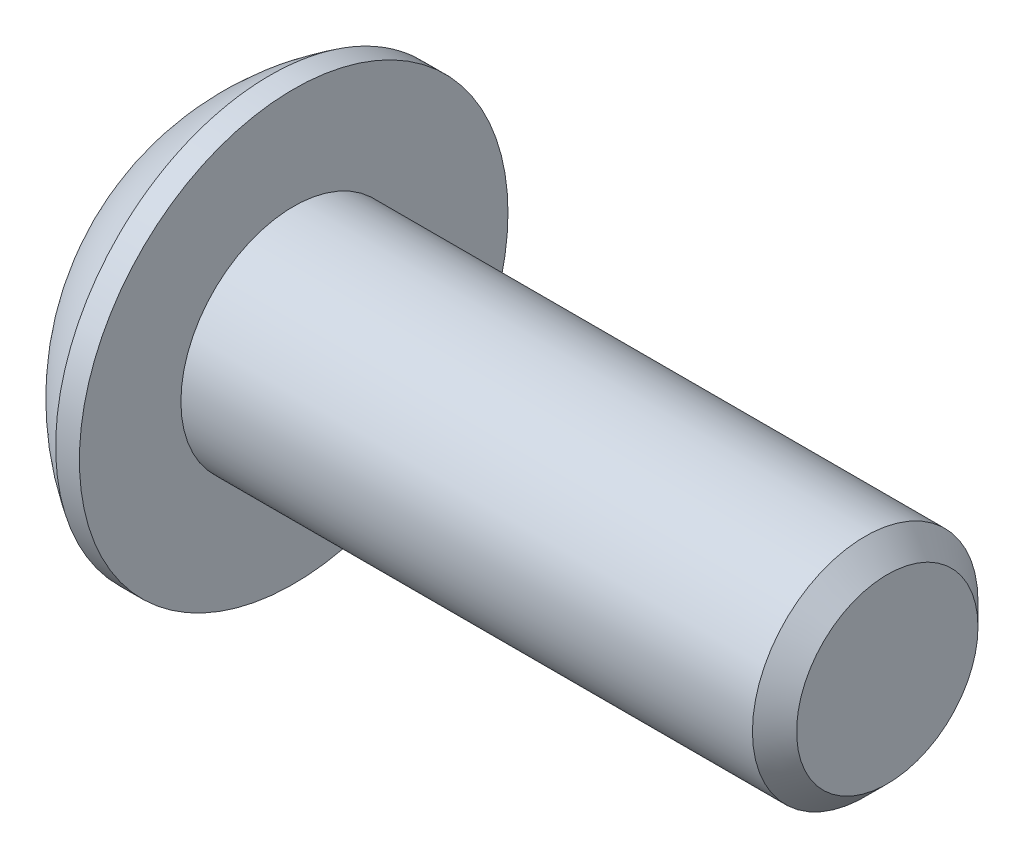
ISO-10303-21;
HEADER;
FILE_DESCRIPTION(('STEP AP214'),'2;1');
FILE_NAME('part.step','',(''),(''),'','','');
FILE_SCHEMA(('AUTOMOTIVE_DESIGN { 1 0 10303 214 1 1 1 1 }'));
ENDSEC;
DATA;
#1=APPLICATION_CONTEXT('core data for automotive mechanical design processes');
#2=APPLICATION_PROTOCOL_DEFINITION('international standard','automotive_design',2000,#1);
#3=PRODUCT_CONTEXT('',#1,'mechanical');
#4=PRODUCT('Part','Part','',(#3));
#5=PRODUCT_RELATED_PRODUCT_CATEGORY('part','',(#4));
#6=PRODUCT_DEFINITION_FORMATION('','',#4);
#7=PRODUCT_DEFINITION_CONTEXT('part definition',#1,'design');
#8=PRODUCT_DEFINITION('design','',#6,#7);
#9=PRODUCT_DEFINITION_SHAPE('','',#8);
#10=(LENGTH_UNIT() NAMED_UNIT(*) SI_UNIT(.MILLI.,.METRE.));
#11=(NAMED_UNIT(*) PLANE_ANGLE_UNIT() SI_UNIT($,.RADIAN.));
#12=(NAMED_UNIT(*) SI_UNIT($,.STERADIAN.) SOLID_ANGLE_UNIT());
#13=UNCERTAINTY_MEASURE_WITH_UNIT(LENGTH_MEASURE(1.E-05),#10,'distance_accuracy_value','');
#14=(GEOMETRIC_REPRESENTATION_CONTEXT(3) GLOBAL_UNCERTAINTY_ASSIGNED_CONTEXT((#13)) GLOBAL_UNIT_ASSIGNED_CONTEXT((#10,
#11,#12)) REPRESENTATION_CONTEXT('',''));
#15=CARTESIAN_POINT('',(0.,0.,0.));
#16=DIRECTION('',(0.,0.,1.));
#17=DIRECTION('',(1.,0.,0.));
#18=AXIS2_PLACEMENT_3D('',#15,#16,#17);
#19=CARTESIAN_POINT('',(1.77800000000017,0.,0.));
#20=DIRECTION('',(-1.,0.,0.));
#21=DIRECTION('',(0.,0.,-1.));
#22=AXIS2_PLACEMENT_3D('',#19,#20,#21);
#23=CONICAL_SURFACE('',#22,1.58749999999985,1.04719755119662);
#24=CARTESIAN_POINT('',(2.69454355233856,0.,0.));
#25=VERTEX_POINT('',#24);
#26=VERTEX_LOOP('',#25);
#27=FACE_BOUND('',#26,.T.);
#28=CARTESIAN_POINT('',(1.77800000000017,0.,0.));
#29=DIRECTION('',(1.,0.,0.));
#30=DIRECTION('',(0.,0.,-1.));
#31=AXIS2_PLACEMENT_3D('',#28,#29,#30);
#32=CIRCLE('',#31,1.58749999999985);
#33=CARTESIAN_POINT('',(1.77800000000008,0.,-1.58749999999993));
#34=VERTEX_POINT('',#33);
#35=CARTESIAN_POINT('',(1.77800000000008,-1.37481532850773,-0.793749999999965));
#36=VERTEX_POINT('',#35);
#37=EDGE_CURVE('E40',#34,#36,#32,.F.);
#38=ORIENTED_EDGE('',*,*,#37,.T.);
#39=CARTESIAN_POINT('',(1.77800000000017,0.,0.));
#40=DIRECTION('',(1.,0.,0.));
#41=DIRECTION('',(0.,0.,-1.));
#42=AXIS2_PLACEMENT_3D('',#39,#40,#41);
#43=CIRCLE('',#42,1.58749999999985);
#44=CARTESIAN_POINT('',(1.77800000000008,-1.37481532850773,0.793749999999965));
#45=VERTEX_POINT('',#44);
#46=EDGE_CURVE('E139',#36,#45,#43,.F.);
#47=ORIENTED_EDGE('',*,*,#46,.T.);
#48=CARTESIAN_POINT('',(1.77800000000017,0.,0.));
#49=DIRECTION('',(1.,0.,0.));
#50=DIRECTION('',(0.,0.,-1.));
#51=AXIS2_PLACEMENT_3D('',#48,#49,#50);
#52=CIRCLE('',#51,1.58749999999985);
#53=CARTESIAN_POINT('',(1.77800000000008,2.13833679173112E-12,1.58749999999993));
#54=VERTEX_POINT('',#53);
#55=EDGE_CURVE('E140',#45,#54,#52,.F.);
#56=ORIENTED_EDGE('',*,*,#55,.T.);
#57=CARTESIAN_POINT('',(1.77800000000017,0.,0.));
#58=DIRECTION('',(1.,0.,0.));
#59=DIRECTION('',(0.,0.,-1.));
#60=AXIS2_PLACEMENT_3D('',#57,#58,#59);
#61=CIRCLE('',#60,1.58749999999985);
#62=CARTESIAN_POINT('',(1.77800000000008,1.37481532850773,0.793749999999963));
#63=VERTEX_POINT('',#62);
#64=EDGE_CURVE('E142',#63,#54,#61,.T.);
#65=ORIENTED_EDGE('',*,*,#64,.F.);
#66=CARTESIAN_POINT('',(1.77800000000017,0.,0.));
#67=DIRECTION('',(1.,0.,0.));
#68=DIRECTION('',(0.,0.,-1.));
#69=AXIS2_PLACEMENT_3D('',#66,#67,#68);
#70=CIRCLE('',#69,1.58749999999985);
#71=CARTESIAN_POINT('',(1.77800000000008,1.37481532850773,-0.793749999999963));
#72=VERTEX_POINT('',#71);
#73=EDGE_CURVE('E135',#72,#63,#70,.T.);
#74=ORIENTED_EDGE('',*,*,#73,.F.);
#75=CARTESIAN_POINT('',(1.77800000000017,0.,0.));
#76=DIRECTION('',(1.,0.,0.));
#77=DIRECTION('',(0.,0.,-1.));
#78=AXIS2_PLACEMENT_3D('',#75,#76,#77);
#79=CIRCLE('',#78,1.58749999999985);
#80=EDGE_CURVE('E112',#34,#72,#79,.T.);
#81=ORIENTED_EDGE('',*,*,#80,.F.);
#82=EDGE_LOOP('',(#38,#47,#56,#65,#74,#81));
#83=FACE_BOUND('',#82,.T.);
#84=ADVANCED_FACE('F37',(#27,#83),#23,.F.);
#85=CARTESIAN_POINT('',(1.778,-1.83308710467706,0.));
#86=DIRECTION('',(1.,0.,0.));
#87=DIRECTION('',(0.,0.,1.));
#88=AXIS2_PLACEMENT_3D('',#85,#86,#87);
#89=PLANE('',#88);
#90=DIRECTION('',(0.,0.500000000000001,-0.866025403784438));
#91=VECTOR('',#90,1.);
#92=CARTESIAN_POINT('',(1.778,-1.83308710467706,0.));
#93=LINE('',#92,#91);
#94=CARTESIAN_POINT('',(1.778,-0.91654355233853,-1.5875));
#95=VERTEX_POINT('',#94);
#96=EDGE_CURVE('E128',#95,#36,#93,.F.);
#97=ORIENTED_EDGE('',*,*,#96,.T.);
#98=ORIENTED_EDGE('',*,*,#37,.F.);
#99=DIRECTION('',(0.,1.,0.));
#100=VECTOR('',#99,1.);
#101=CARTESIAN_POINT('',(1.778,-0.916543552338531,-1.5875));
#102=LINE('',#101,#100);
#103=EDGE_CURVE('E117',#34,#95,#102,.F.);
#104=ORIENTED_EDGE('',*,*,#103,.T.);
#105=EDGE_LOOP('',(#97,#98,#104));
#106=FACE_BOUND('',#105,.T.);
#107=ADVANCED_FACE('F137',(#106),#89,.F.);
#108=CARTESIAN_POINT('',(1.778,-1.83308710467706,0.));
#109=DIRECTION('',(1.,0.,0.));
#110=DIRECTION('',(0.,0.,1.));
#111=AXIS2_PLACEMENT_3D('',#108,#109,#110);
#112=PLANE('',#111);
#113=DIRECTION('',(0.,-0.500000000000001,-0.866025403784438));
#114=VECTOR('',#113,1.);
#115=CARTESIAN_POINT('',(1.778,-0.916543552338531,1.5875));
#116=LINE('',#115,#114);
#117=CARTESIAN_POINT('',(1.778,-1.83308710467706,0.));
#118=VERTEX_POINT('',#117);
#119=EDGE_CURVE('E233',#118,#45,#116,.F.);
#120=ORIENTED_EDGE('',*,*,#119,.T.);
#121=ORIENTED_EDGE('',*,*,#46,.F.);
#122=DIRECTION('',(0.,0.500000000000001,-0.866025403784438));
#123=VECTOR('',#122,1.);
#124=CARTESIAN_POINT('',(1.778,-1.83308710467706,0.));
#125=LINE('',#124,#123);
#126=EDGE_CURVE('E243',#36,#118,#125,.F.);
#127=ORIENTED_EDGE('',*,*,#126,.T.);
#128=EDGE_LOOP('',(#120,#121,#127));
#129=FACE_BOUND('',#128,.T.);
#130=ADVANCED_FACE('F293',(#129),#112,.F.);
#131=CARTESIAN_POINT('',(1.778,-1.83308710467706,0.));
#132=DIRECTION('',(1.,0.,0.));
#133=DIRECTION('',(0.,0.,1.));
#134=AXIS2_PLACEMENT_3D('',#131,#132,#133);
#135=PLANE('',#134);
#136=DIRECTION('',(0.,1.,0.));
#137=VECTOR('',#136,1.);
#138=CARTESIAN_POINT('',(1.778,0.91654355233853,1.5875));
#139=LINE('',#138,#137);
#140=CARTESIAN_POINT('',(1.778,-0.916543552338531,1.5875));
#141=VERTEX_POINT('',#140);
#142=EDGE_CURVE('E219',#141,#54,#139,.T.);
#143=ORIENTED_EDGE('',*,*,#142,.T.);
#144=ORIENTED_EDGE('',*,*,#55,.F.);
#145=DIRECTION('',(0.,-0.500000000000001,-0.866025403784438));
#146=VECTOR('',#145,1.);
#147=CARTESIAN_POINT('',(1.778,-0.916543552338531,1.5875));
#148=LINE('',#147,#146);
#149=EDGE_CURVE('E230',#45,#141,#148,.F.);
#150=ORIENTED_EDGE('',*,*,#149,.T.);
#151=EDGE_LOOP('',(#143,#144,#150));
#152=FACE_BOUND('',#151,.T.);
#153=ADVANCED_FACE('F297',(#152),#135,.F.);
#154=CARTESIAN_POINT('',(1.778,-1.83308710467706,0.));
#155=DIRECTION('',(1.,0.,0.));
#156=DIRECTION('',(0.,0.,1.));
#157=AXIS2_PLACEMENT_3D('',#154,#155,#156);
#158=PLANE('',#157);
#159=DIRECTION('',(0.,-0.5,0.866025403784439));
#160=VECTOR('',#159,1.);
#161=CARTESIAN_POINT('',(1.778,1.83308710467706,0.));
#162=LINE('',#161,#160);
#163=CARTESIAN_POINT('',(1.778,0.916543552338531,1.5875));
#164=VERTEX_POINT('',#163);
#165=EDGE_CURVE('E205',#164,#63,#162,.F.);
#166=ORIENTED_EDGE('',*,*,#165,.T.);
#167=ORIENTED_EDGE('',*,*,#64,.T.);
#168=DIRECTION('',(0.,1.,0.));
#169=VECTOR('',#168,1.);
#170=CARTESIAN_POINT('',(1.778,0.91654355233853,1.5875));
#171=LINE('',#170,#169);
#172=EDGE_CURVE('E216',#54,#164,#171,.T.);
#173=ORIENTED_EDGE('',*,*,#172,.T.);
#174=EDGE_LOOP('',(#166,#167,#173));
#175=FACE_BOUND('',#174,.T.);
#176=ADVANCED_FACE('F303',(#175),#158,.F.);
#177=CARTESIAN_POINT('',(1.778,-1.83308710467706,0.));
#178=DIRECTION('',(1.,0.,0.));
#179=DIRECTION('',(0.,0.,1.));
#180=AXIS2_PLACEMENT_3D('',#177,#178,#179);
#181=PLANE('',#180);
#182=DIRECTION('',(0.,0.5,0.866025403784439));
#183=VECTOR('',#182,1.);
#184=CARTESIAN_POINT('',(1.778,0.916543552338531,-1.5875));
#185=LINE('',#184,#183);
#186=CARTESIAN_POINT('',(1.778,1.83308710467706,0.));
#187=VERTEX_POINT('',#186);
#188=EDGE_CURVE('E187',#187,#72,#185,.F.);
#189=ORIENTED_EDGE('',*,*,#188,.T.);
#190=ORIENTED_EDGE('',*,*,#73,.T.);
#191=DIRECTION('',(0.,-0.5,0.866025403784439));
#192=VECTOR('',#191,1.);
#193=CARTESIAN_POINT('',(1.778,1.83308710467706,0.));
#194=LINE('',#193,#192);
#195=EDGE_CURVE('E202',#63,#187,#194,.F.);
#196=ORIENTED_EDGE('',*,*,#195,.T.);
#197=EDGE_LOOP('',(#189,#190,#196));
#198=FACE_BOUND('',#197,.T.);
#199=ADVANCED_FACE('F307',(#198),#181,.F.);
#200=CARTESIAN_POINT('',(1.778,-1.83308710467706,0.));
#201=DIRECTION('',(1.,0.,0.));
#202=DIRECTION('',(0.,0.,1.));
#203=AXIS2_PLACEMENT_3D('',#200,#201,#202);
#204=PLANE('',#203);
#205=DIRECTION('',(0.,1.,0.));
#206=VECTOR('',#205,1.);
#207=CARTESIAN_POINT('',(1.778,-0.916543552338531,-1.5875));
#208=LINE('',#207,#206);
#209=CARTESIAN_POINT('',(1.778,0.91654355233853,-1.5875));
#210=VERTEX_POINT('',#209);
#211=EDGE_CURVE('E108',#210,#34,#208,.F.);
#212=ORIENTED_EDGE('',*,*,#211,.T.);
#213=ORIENTED_EDGE('',*,*,#80,.T.);
#214=DIRECTION('',(0.,0.5,0.866025403784439));
#215=VECTOR('',#214,1.);
#216=CARTESIAN_POINT('',(1.778,0.916543552338531,-1.5875));
#217=LINE('',#216,#215);
#218=EDGE_CURVE('E114',#72,#210,#217,.F.);
#219=ORIENTED_EDGE('',*,*,#218,.T.);
#220=EDGE_LOOP('',(#212,#213,#219));
#221=FACE_BOUND('',#220,.T.);
#222=ADVANCED_FACE('F110',(#221),#204,.F.);
#223=CARTESIAN_POINT('',(1.778,-0.916543552338531,-1.5875));
#224=DIRECTION('',(0.,0.,1.));
#225=DIRECTION('',(0.,1.,0.));
#226=AXIS2_PLACEMENT_3D('',#223,#224,#225);
#227=PLANE('',#226);
#228=DIRECTION('',(0.,1.,0.));
#229=VECTOR('',#228,1.);
#230=CARTESIAN_POINT('',(0.,0.,-1.5875));
#231=LINE('',#230,#229);
#232=CARTESIAN_POINT('',(0.,0.91654355233853,-1.5875));
#233=VERTEX_POINT('',#232);
#234=CARTESIAN_POINT('',(0.,-0.91654355233853,-1.5875));
#235=VERTEX_POINT('',#234);
#236=EDGE_CURVE('E184',#233,#235,#231,.F.);
#237=ORIENTED_EDGE('',*,*,#236,.T.);
#238=DIRECTION('',(1.,0.,0.));
#239=VECTOR('',#238,1.);
#240=CARTESIAN_POINT('',(1.778,-0.91654355233853,-1.5875));
#241=LINE('',#240,#239);
#242=EDGE_CURVE('E123',#235,#95,#241,.T.);
#243=ORIENTED_EDGE('',*,*,#242,.T.);
#244=ORIENTED_EDGE('',*,*,#103,.F.);
#245=ORIENTED_EDGE('',*,*,#211,.F.);
#246=DIRECTION('',(1.,0.,0.));
#247=VECTOR('',#246,1.);
#248=CARTESIAN_POINT('',(1.778,0.916543552338531,-1.5875));
#249=LINE('',#248,#247);
#250=EDGE_CURVE('E194',#210,#233,#249,.F.);
#251=ORIENTED_EDGE('',*,*,#250,.T.);
#252=EDGE_LOOP('',(#237,#243,#244,#245,#251));
#253=FACE_BOUND('',#252,.T.);
#254=ADVANCED_FACE('F121',(#253),#227,.T.);
#255=CARTESIAN_POINT('',(1.778,-1.83308710467706,0.));
#256=DIRECTION('',(0.,0.866025403784438,0.500000000000001));
#257=DIRECTION('',(0.,0.500000000000001,-0.866025403784438));
#258=AXIS2_PLACEMENT_3D('',#255,#256,#257);
#259=PLANE('',#258);
#260=DIRECTION('',(0.,-0.500000000000001,0.866025403784438));
#261=VECTOR('',#260,1.);
#262=CARTESIAN_POINT('',(0.,-0.916543552338531,-1.5875));
#263=LINE('',#262,#261);
#264=CARTESIAN_POINT('',(0.,-1.83308710467706,0.));
#265=VERTEX_POINT('',#264);
#266=EDGE_CURVE('E181',#235,#265,#263,.T.);
#267=ORIENTED_EDGE('',*,*,#266,.T.);
#268=DIRECTION('',(1.,0.,0.));
#269=VECTOR('',#268,1.);
#270=CARTESIAN_POINT('',(1.778,-1.83308710467706,0.));
#271=LINE('',#270,#269);
#272=EDGE_CURVE('E227',#265,#118,#271,.T.);
#273=ORIENTED_EDGE('',*,*,#272,.T.);
#274=ORIENTED_EDGE('',*,*,#126,.F.);
#275=ORIENTED_EDGE('',*,*,#96,.F.);
#276=ORIENTED_EDGE('',*,*,#242,.F.);
#277=EDGE_LOOP('',(#267,#273,#274,#275,#276));
#278=FACE_BOUND('',#277,.T.);
#279=ADVANCED_FACE('F316',(#278),#259,.T.);
#280=CARTESIAN_POINT('',(1.778,-0.916543552338531,1.5875));
#281=DIRECTION('',(0.,0.866025403784438,-0.500000000000001));
#282=DIRECTION('',(0.,-0.500000000000001,-0.866025403784438));
#283=AXIS2_PLACEMENT_3D('',#280,#281,#282);
#284=PLANE('',#283);
#285=DIRECTION('',(0.,0.500000000000001,0.866025403784438));
#286=VECTOR('',#285,1.);
#287=CARTESIAN_POINT('',(0.,-1.83308710467706,0.));
#288=LINE('',#287,#286);
#289=CARTESIAN_POINT('',(0.,-0.916543552338531,1.5875));
#290=VERTEX_POINT('',#289);
#291=EDGE_CURVE('E178',#265,#290,#288,.T.);
#292=ORIENTED_EDGE('',*,*,#291,.T.);
#293=DIRECTION('',(1.,0.,0.));
#294=VECTOR('',#293,1.);
#295=CARTESIAN_POINT('',(1.778,-0.916543552338531,1.5875));
#296=LINE('',#295,#294);
#297=EDGE_CURVE('E213',#290,#141,#296,.T.);
#298=ORIENTED_EDGE('',*,*,#297,.T.);
#299=ORIENTED_EDGE('',*,*,#149,.F.);
#300=ORIENTED_EDGE('',*,*,#119,.F.);
#301=ORIENTED_EDGE('',*,*,#272,.F.);
#302=EDGE_LOOP('',(#292,#298,#299,#300,#301));
#303=FACE_BOUND('',#302,.T.);
#304=ADVANCED_FACE('F319',(#303),#284,.T.);
#305=CARTESIAN_POINT('',(1.778,0.91654355233853,1.5875));
#306=DIRECTION('',(0.,0.,-1.));
#307=DIRECTION('',(1.,0.,0.));
#308=AXIS2_PLACEMENT_3D('',#305,#306,#307);
#309=PLANE('',#308);
#310=DIRECTION('',(0.,1.,0.));
#311=VECTOR('',#310,1.);
#312=CARTESIAN_POINT('',(0.,0.,1.5875));
#313=LINE('',#312,#311);
#314=CARTESIAN_POINT('',(0.,0.91654355233853,1.5875));
#315=VERTEX_POINT('',#314);
#316=EDGE_CURVE('E175',#290,#315,#313,.T.);
#317=ORIENTED_EDGE('',*,*,#316,.T.);
#318=DIRECTION('',(1.,0.,0.));
#319=VECTOR('',#318,1.);
#320=CARTESIAN_POINT('',(1.778,0.91654355233853,1.5875));
#321=LINE('',#320,#319);
#322=EDGE_CURVE('E190',#315,#164,#321,.T.);
#323=ORIENTED_EDGE('',*,*,#322,.T.);
#324=ORIENTED_EDGE('',*,*,#172,.F.);
#325=ORIENTED_EDGE('',*,*,#142,.F.);
#326=ORIENTED_EDGE('',*,*,#297,.F.);
#327=EDGE_LOOP('',(#317,#323,#324,#325,#326));
#328=FACE_BOUND('',#327,.T.);
#329=ADVANCED_FACE('F323',(#328),#309,.T.);
#330=CARTESIAN_POINT('',(1.778,1.83308710467706,0.));
#331=DIRECTION('',(0.,-0.866025403784439,-0.5));
#332=DIRECTION('',(0.,-0.5,0.866025403784439));
#333=AXIS2_PLACEMENT_3D('',#330,#331,#332);
#334=PLANE('',#333);
#335=DIRECTION('',(0.,0.5,-0.866025403784439));
#336=VECTOR('',#335,1.);
#337=CARTESIAN_POINT('',(0.,0.91654355233853,1.5875));
#338=LINE('',#337,#336);
#339=CARTESIAN_POINT('',(0.,1.83308710467706,0.));
#340=VERTEX_POINT('',#339);
#341=EDGE_CURVE('E172',#315,#340,#338,.T.);
#342=ORIENTED_EDGE('',*,*,#341,.T.);
#343=DIRECTION('',(1.,0.,0.));
#344=VECTOR('',#343,1.);
#345=CARTESIAN_POINT('',(1.778,1.83308710467706,0.));
#346=LINE('',#345,#344);
#347=EDGE_CURVE('E186',#340,#187,#346,.T.);
#348=ORIENTED_EDGE('',*,*,#347,.T.);
#349=ORIENTED_EDGE('',*,*,#195,.F.);
#350=ORIENTED_EDGE('',*,*,#165,.F.);
#351=ORIENTED_EDGE('',*,*,#322,.F.);
#352=EDGE_LOOP('',(#342,#348,#349,#350,#351));
#353=FACE_BOUND('',#352,.T.);
#354=ADVANCED_FACE('F327',(#353),#334,.T.);
#355=CARTESIAN_POINT('',(1.778,0.916543552338531,-1.5875));
#356=DIRECTION('',(0.,-0.866025403784439,0.5));
#357=DIRECTION('',(0.,0.5,0.866025403784439));
#358=AXIS2_PLACEMENT_3D('',#355,#356,#357);
#359=PLANE('',#358);
#360=DIRECTION('',(0.,-0.5,-0.866025403784439));
#361=VECTOR('',#360,1.);
#362=CARTESIAN_POINT('',(0.,1.83308710467706,0.));
#363=LINE('',#362,#361);
#364=EDGE_CURVE('E55',#340,#233,#363,.T.);
#365=ORIENTED_EDGE('',*,*,#364,.T.);
#366=ORIENTED_EDGE('',*,*,#250,.F.);
#367=ORIENTED_EDGE('',*,*,#218,.F.);
#368=ORIENTED_EDGE('',*,*,#188,.F.);
#369=ORIENTED_EDGE('',*,*,#347,.F.);
#370=EDGE_LOOP('',(#365,#366,#367,#368,#369));
#371=FACE_BOUND('',#370,.T.);
#372=ADVANCED_FACE('F330',(#371),#359,.T.);
#373=CARTESIAN_POINT('',(0.,0.,0.));
#374=DIRECTION('',(-1.,0.,0.));
#375=DIRECTION('',(0.,0.,-1.));
#376=AXIS2_PLACEMENT_3D('',#373,#374,#375);
#377=PLANE('',#376);
#378=ORIENTED_EDGE('',*,*,#341,.F.);
#379=ORIENTED_EDGE('',*,*,#316,.F.);
#380=ORIENTED_EDGE('',*,*,#291,.F.);
#381=ORIENTED_EDGE('',*,*,#266,.F.);
#382=ORIENTED_EDGE('',*,*,#236,.F.);
#383=ORIENTED_EDGE('',*,*,#364,.F.);
#384=EDGE_LOOP('',(#378,#379,#380,#381,#382,#383));
#385=FACE_BOUND('',#384,.T.);
#386=CARTESIAN_POINT('',(0.,2.29235,0.));
#387=CARTESIAN_POINT('',(0.,2.29234961429956,-0.0643619991867157));
#388=CARTESIAN_POINT('',(0.,2.28963695190108,-0.128735826629365));
#389=CARTESIAN_POINT('',(0.,2.27880393843647,-0.257038618985287));
#390=CARTESIAN_POINT('',(0.,2.27068199085126,-0.320967446929162));
#391=CARTESIAN_POINT('',(0.,2.24906694794255,-0.448021254607718));
#392=CARTESIAN_POINT('',(-2.11703149837134E-13,2.2355653265346,-0.511144793381861));
#393=CARTESIAN_POINT('',(2.1187530643504E-13,2.20328400495644,-0.636065176149322));
#394=CARTESIAN_POINT('',(7.91146566793156E-13,2.18450002159113,-0.697860899533935));
#395=CARTESIAN_POINT('',(1.31559514040798E-12,2.12048422735802,-0.880329802927749));
#396=CARTESIAN_POINT('',(0.,2.06753599079458,-0.998391795928117));
#397=CARTESIAN_POINT('',(0.,1.94254204858672,-1.22393765942147));
#398=CARTESIAN_POINT('',(1.09192493676844E-12,1.87049561696642,-1.33142112758208));
#399=CARTESIAN_POINT('',(6.76836354300497E-13,1.7497425419488,-1.48237719670935));
#400=CARTESIAN_POINT('',(1.81300934573179E-13,1.707345731323,-1.53101280076738));
#401=CARTESIAN_POINT('',(-1.81126133165542E-13,1.61863910291528,-1.62450601319185));
#402=CARTESIAN_POINT('',(0.,1.57233309727312,-1.66936721890417));
#403=CARTESIAN_POINT('',(0.,1.47608431707232,-1.7550488420402));
#404=CARTESIAN_POINT('',(0.,1.42613990458994,-1.79586741981512));
#405=CARTESIAN_POINT('',(0.,1.3229945254125,-1.87315615311523));
#406=CARTESIAN_POINT('',(0.,1.26979280714187,-1.90962529930697));
#407=CARTESIAN_POINT('',(0.,1.10588180153951,-2.01207722151089));
#408=CARTESIAN_POINT('',(0.,0.990764947001302,-2.07119486286666));
#409=CARTESIAN_POINT('',(0.,0.75230219883971,-2.16922858468856));
#410=CARTESIAN_POINT('',(0.,0.628956393121253,-2.2081448809145));
#411=CARTESIAN_POINT('',(0.,0.377466101733263,-2.2647275576592));
#412=CARTESIAN_POINT('',(0.,0.249321590440373,-2.28239382469379));
#413=CARTESIAN_POINT('',(0.,-0.00811435371611411,-2.29595665980955));
#414=CARTESIAN_POINT('',(0.,-0.137405786579712,-2.29185322789072));
#415=CARTESIAN_POINT('',(0.,-0.393449386933732,-2.2620096240906));
#416=CARTESIAN_POINT('',(0.,-0.52020156798109,-2.23626956775766));
#417=CARTESIAN_POINT('',(0.,-0.767645294384457,-2.16383549332687));
#418=CARTESIAN_POINT('',(0.,-0.888336774993562,-2.11714125142685));
#419=CARTESIAN_POINT('',(0.,-1.06210572146657,-2.03247976453654));
#420=CARTESIAN_POINT('',(0.,-1.11884498714067,-2.00180278323695));
#421=CARTESIAN_POINT('',(0.,-1.22954062855574,-1.93578011658036));
#422=CARTESIAN_POINT('',(0.,-1.28349764565393,-1.9004355139425));
#423=CARTESIAN_POINT('',(0.,-1.38821676641538,-1.82534174602348));
#424=CARTESIAN_POINT('',(0.,-1.43898030563029,-1.78559458231503));
#425=CARTESIAN_POINT('',(0.,-1.53701984534432,-1.70193996292362));
#426=CARTESIAN_POINT('',(0.,-1.58429243280552,-1.65802852924127));
#427=CARTESIAN_POINT('',(0.,-1.72023903553759,-1.52059650554139));
#428=CARTESIAN_POINT('',(0.,-1.80318066138239,-1.42127847626519));
#429=CARTESIAN_POINT('',(0.,-1.95118232345099,-1.21011519784664));
#430=CARTESIAN_POINT('',(0.,-2.01624303935585,-1.09827042509272));
#431=CARTESIAN_POINT('',(0.,-2.09907772661316,-0.923538238005837));
#432=CARTESIAN_POINT('',(0.,-2.12425103063559,-0.864058373981964));
#433=CARTESIAN_POINT('',(0.,-2.16947990046566,-0.743221562175598));
#434=CARTESIAN_POINT('',(0.,-2.18953960800685,-0.681866178863364));
#435=CARTESIAN_POINT('',(0.,-2.22438542051157,-0.557786972400356));
#436=CARTESIAN_POINT('',(0.,-2.23917985294819,-0.495065478128172));
#437=CARTESIAN_POINT('',(0.,-2.26343456384454,-0.368611258323514));
#438=CARTESIAN_POINT('',(0.,-2.27289641559287,-0.304878836759568));
#439=CARTESIAN_POINT('',(0.,-2.28388649696738,-0.200873029360624));
#440=CARTESIAN_POINT('',(0.,-2.28705930623294,-0.160766164180097));
#441=CARTESIAN_POINT('',(0.,-2.29129117827045,-0.0804410725432709));
#442=CARTESIAN_POINT('',(0.,-2.29235024104239,-0.0402228460869714));
#443=CARTESIAN_POINT('',(0.,-2.29234961429957,0.064361999186717));
#444=CARTESIAN_POINT('',(0.,-2.28963695190109,0.128735826629367));
#445=CARTESIAN_POINT('',(0.,-2.27880393843649,0.257038618985288));
#446=CARTESIAN_POINT('',(0.,-2.27068199085127,0.320967446929164));
#447=CARTESIAN_POINT('',(0.,-2.24906694794256,0.448021254607719));
#448=CARTESIAN_POINT('',(-2.10953888396123E-13,-2.23556532653461,0.511144793381863));
#449=CARTESIAN_POINT('',(2.11125435696053E-13,-2.20328400495644,0.636065176149323));
#450=CARTESIAN_POINT('',(7.88346583487223E-13,-2.18450002159114,0.697860899533937));
#451=CARTESIAN_POINT('',(1.3107899574181E-12,-2.12048422735803,0.88032980292775));
#452=CARTESIAN_POINT('',(0.,-2.06753599079459,0.998391795928119));
#453=CARTESIAN_POINT('',(0.,-1.94254204858673,1.22393765942147));
#454=CARTESIAN_POINT('',(1.0896980055778E-12,-1.87049561696643,1.33142112758208));
#455=CARTESIAN_POINT('',(6.75348057169845E-13,-1.74974254194881,1.48237719670935));
#456=CARTESIAN_POINT('',(1.80902214372941E-13,-1.70734573132301,1.53101280076738));
#457=CARTESIAN_POINT('',(-1.80727797391631E-13,-1.61863910291529,1.62450601319185));
#458=CARTESIAN_POINT('',(0.,-1.57233309727313,1.66936721890417));
#459=CARTESIAN_POINT('',(0.,-1.47608431707233,1.7550488420402));
#460=CARTESIAN_POINT('',(0.,-1.42613990458994,1.79586741981512));
#461=CARTESIAN_POINT('',(0.,-1.32299452541251,1.87315615311523));
#462=CARTESIAN_POINT('',(0.,-1.26979280714188,1.90962529930697));
#463=CARTESIAN_POINT('',(0.,-1.10588180153953,2.0120772215109));
#464=CARTESIAN_POINT('',(0.,-0.990764947001314,2.07119486286666));
#465=CARTESIAN_POINT('',(0.,-0.752302198839719,2.16922858468856));
#466=CARTESIAN_POINT('',(0.,-0.628956393121263,2.2081448809145));
#467=CARTESIAN_POINT('',(0.,-0.377466101733273,2.2647275576592));
#468=CARTESIAN_POINT('',(0.,-0.249321590440383,2.28239382469379));
#469=CARTESIAN_POINT('',(0.,0.00811435371610458,2.29595665980955));
#470=CARTESIAN_POINT('',(0.,0.137405786579702,2.29185322789072));
#471=CARTESIAN_POINT('',(0.,0.393449386933722,2.2620096240906));
#472=CARTESIAN_POINT('',(0.,0.52020156798108,2.23626956775766));
#473=CARTESIAN_POINT('',(0.,0.767645294384448,2.16383549332687));
#474=CARTESIAN_POINT('',(0.,0.888336774993553,2.11714125142685));
#475=CARTESIAN_POINT('',(0.,1.06210572146656,2.03247976453653));
#476=CARTESIAN_POINT('',(0.,1.11884498714066,2.00180278323695));
#477=CARTESIAN_POINT('',(0.,1.22954062855573,1.93578011658035));
#478=CARTESIAN_POINT('',(0.,1.28349764565393,1.9004355139425));
#479=CARTESIAN_POINT('',(0.,1.38821676641538,1.82534174602348));
#480=CARTESIAN_POINT('',(0.,1.43898030563029,1.78559458231503));
#481=CARTESIAN_POINT('',(0.,1.53701984534431,1.70193996292362));
#482=CARTESIAN_POINT('',(0.,1.58429243280551,1.65802852924127));
#483=CARTESIAN_POINT('',(0.,1.72023903553758,1.52059650554139));
#484=CARTESIAN_POINT('',(0.,1.80318066138238,1.42127847626519));
#485=CARTESIAN_POINT('',(0.,1.95118232345098,1.21011519784663));
#486=CARTESIAN_POINT('',(0.,2.01624303935584,1.09827042509272));
#487=CARTESIAN_POINT('',(0.,2.09907772661314,0.923538238005834));
#488=CARTESIAN_POINT('',(0.,2.12425103063558,0.864058373981962));
#489=CARTESIAN_POINT('',(0.,2.16947990046565,0.743221562175596));
#490=CARTESIAN_POINT('',(0.,2.18953960800684,0.681866178863361));
#491=CARTESIAN_POINT('',(0.,2.22438542051156,0.557786972400352));
#492=CARTESIAN_POINT('',(0.,2.23917985294818,0.495065478128168));
#493=CARTESIAN_POINT('',(0.,2.26343456384453,0.368611258323511));
#494=CARTESIAN_POINT('',(0.,2.27289641559285,0.304878836759565));
#495=CARTESIAN_POINT('',(0.,2.28388649696736,0.200873029360621));
#496=CARTESIAN_POINT('',(0.,2.28705930623293,0.160766164180095));
#497=CARTESIAN_POINT('',(0.,2.29129117827044,0.0804410725432707));
#498=CARTESIAN_POINT('',(0.,2.29235024104238,0.0402228460869719));
#499=CARTESIAN_POINT('',(0.,2.29235,0.));
#500=B_SPLINE_CURVE_WITH_KNOTS('',3,(#386,#387,#388,#389,#390,#391,#392,#393,#394,#395,#396,
#397,#398,#399,#400,#401,#402,#403,#404,#405,#406,#407,#408,#409,#410,#411,#412,#413,#414,#415,
#416,#417,#418,#419,#420,#421,#422,#423,#424,#425,#426,#427,#428,#429,#430,#431,#432,#433,#434,
#435,#436,#437,#438,#439,#440,#441,#442,#443,#444,#445,#446,#447,#448,#449,#450,#451,#452,#453,
#454,#455,#456,#457,#458,#459,#460,#461,#462,#463,#464,#465,#466,#467,#468,#469,#470,#471,#472,
#473,#474,#475,#476,#477,#478,#479,#480,#481,#482,#483,#484,#485,#486,#487,#488,#489,#490,#491,
#492,#493,#494,#495,#496,#497,#498,#499),.UNSPECIFIED.,.T.,.F.,(4,2,2,2,2,2,2,2,2,2,2,2,2,2,2,2,
2,2,2,2,2,2,2,2,2,2,2,2,2,2,2,2,2,2,2,2,2,2,2,2,2,2,2,2,2,2,2,2,2,2,2,2,2,2,2,2,4),(0.,
0.193048968618034,0.386154939782395,0.579568183995959,0.773138711491039,1.15935703864578,
1.54559004914645,1.73895960916368,1.93214273180063,2.12541336477222,2.31872876140889,
2.70495649282619,3.09118009906583,3.47740576789432,3.86363143672285,4.24985504296254,
4.63608277437979,4.8293981710162,5.02266880398748,5.2158519266242,5.40922148664122,
5.79545449714217,6.18167282429725,6.37524335179261,6.56865659600642,6.76176256717089,
6.95481153578908,7.07545693291922,7.19610233004937,7.3891512986674,7.58225726983176,
7.77567051404533,7.96924104154041,8.35545936869515,8.74169237919582,8.93506193921305,
9.12824506185,9.32151569482159,9.51483109145826,9.90105882287556,10.2872824291152,
10.6735080979437,11.0597337667722,11.4459573730119,11.8321851044292,12.0255005010656,
12.2187711340369,12.4119542566736,12.6053238166906,12.9915568271915,13.3777751543466,
13.571345681842,13.7647589260558,13.9578648972203,14.1509138658385,14.2715592629686,
14.3922046600987),.UNSPECIFIED.);
#501=CARTESIAN_POINT('',(0.,2.29235,0.));
#502=VERTEX_POINT('',#501);
#503=EDGE_CURVE('E148',#502,#502,#500,.T.);
#504=ORIENTED_EDGE('',*,*,#503,.T.);
#505=EDGE_LOOP('',(#504));
#506=FACE_BOUND('',#505,.T.);
#507=ADVANCED_FACE('F157',(#385,#506),#377,.T.);
#508=CARTESIAN_POINT('',(4.85989606481482,0.,0.));
#509=DIRECTION('',(0.,1.,0.));
#510=DIRECTION('',(1.,0.,0.));
#511=AXIS2_PLACEMENT_3D('',#508,#509,#510);
#512=SPHERICAL_SURFACE('',#511,5.37340285883188);
#513=CARTESIAN_POINT('',(2.0574,0.,0.));
#514=DIRECTION('',(1.,0.,0.));
#515=DIRECTION('',(0.,0.,-1.));
#516=AXIS2_PLACEMENT_3D('',#513,#514,#515);
#517=CIRCLE('',#516,4.5847);
#518=CARTESIAN_POINT('',(2.0574,0.,-4.5847));
#519=VERTEX_POINT('',#518);
#520=EDGE_CURVE('E155',#519,#519,#517,.F.);
#521=ORIENTED_EDGE('',*,*,#520,.T.);
#522=EDGE_LOOP('',(#521));
#523=FACE_BOUND('',#522,.T.);
#524=ORIENTED_EDGE('',*,*,#503,.F.);
#525=EDGE_LOOP('',(#524));
#526=FACE_BOUND('',#525,.T.);
#527=ADVANCED_FACE('F160',(#523,#526),#512,.T.);
#528=CARTESIAN_POINT('',(15.2654,0.,0.));
#529=DIRECTION('',(-1.,0.,0.));
#530=DIRECTION('',(0.,0.,-1.));
#531=AXIS2_PLACEMENT_3D('',#528,#529,#530);
#532=PLANE('',#531);
#533=CARTESIAN_POINT('',(15.2654000000325,0.,0.));
#534=DIRECTION('',(1.,0.,0.));
#535=DIRECTION('',(0.,0.,-1.));
#536=AXIS2_PLACEMENT_3D('',#533,#534,#535);
#537=CIRCLE('',#536,1.94055999992315);
#538=CARTESIAN_POINT('',(15.2654000000325,0.,-1.94055999992315));
#539=VERTEX_POINT('',#538);
#540=EDGE_CURVE('E261',#539,#539,#537,.T.);
#541=ORIENTED_EDGE('',*,*,#540,.T.);
#542=EDGE_LOOP('',(#541));
#543=FACE_BOUND('',#542,.T.);
#544=ADVANCED_FACE('F165',(#543),#532,.F.);
#545=CARTESIAN_POINT('',(0.,0.,0.));
#546=DIRECTION('',(-1.,0.,0.));
#547=DIRECTION('',(0.,0.,-1.));
#548=AXIS2_PLACEMENT_3D('',#545,#546,#547);
#549=CYLINDRICAL_SURFACE('',#548,4.5847);
#550=ORIENTED_EDGE('',*,*,#520,.F.);
#551=EDGE_LOOP('',(#550));
#552=FACE_BOUND('',#551,.T.);
#553=CARTESIAN_POINT('',(2.5654,0.,0.));
#554=DIRECTION('',(1.,0.,0.));
#555=DIRECTION('',(0.,0.,-1.));
#556=AXIS2_PLACEMENT_3D('',#553,#554,#555);
#557=CIRCLE('',#556,4.5847);
#558=CARTESIAN_POINT('',(2.5654,0.,-4.5847));
#559=VERTEX_POINT('',#558);
#560=EDGE_CURVE('E259',#559,#559,#557,.T.);
#561=ORIENTED_EDGE('',*,*,#560,.F.);
#562=EDGE_LOOP('',(#561));
#563=FACE_BOUND('',#562,.T.);
#564=ADVANCED_FACE('F269',(#552,#563),#549,.T.);
#565=CARTESIAN_POINT('',(14.7929600000793,0.,0.));
#566=DIRECTION('',(-1.,0.,0.));
#567=DIRECTION('',(0.,0.,-1.));
#568=AXIS2_PLACEMENT_3D('',#565,#566,#567);
#569=CONICAL_SURFACE('',#568,2.41299999987632,0.785398163397448);
#570=CARTESIAN_POINT('',(14.79296,0.,0.));
#571=DIRECTION('',(1.,0.,0.));
#572=DIRECTION('',(0.,0.,-1.));
#573=AXIS2_PLACEMENT_3D('',#570,#571,#572);
#574=CIRCLE('',#573,2.41299999999999);
#575=CARTESIAN_POINT('',(14.79296,0.,-2.41299999999999));
#576=VERTEX_POINT('',#575);
#577=EDGE_CURVE('E46',#576,#576,#574,.T.);
#578=ORIENTED_EDGE('',*,*,#577,.T.);
#579=EDGE_LOOP('',(#578));
#580=FACE_BOUND('',#579,.T.);
#581=ORIENTED_EDGE('',*,*,#540,.F.);
#582=EDGE_LOOP('',(#581));
#583=FACE_BOUND('',#582,.T.);
#584=ADVANCED_FACE('F272',(#580,#583),#569,.T.);
#585=CARTESIAN_POINT('',(2.5654,2.41299999999999,0.));
#586=DIRECTION('',(-1.,0.,0.));
#587=DIRECTION('',(0.,0.,-1.));
#588=AXIS2_PLACEMENT_3D('',#585,#586,#587);
#589=PLANE('',#588);
#590=CARTESIAN_POINT('',(2.5654,0.,0.));
#591=DIRECTION('',(1.,0.,0.));
#592=DIRECTION('',(0.,0.,-1.));
#593=AXIS2_PLACEMENT_3D('',#590,#591,#592);
#594=CIRCLE('',#593,2.41299999999999);
#595=CARTESIAN_POINT('',(2.5654,0.,-2.41299999999999));
#596=VERTEX_POINT('',#595);
#597=EDGE_CURVE('E11',#596,#596,#594,.F.);
#598=ORIENTED_EDGE('',*,*,#597,.T.);
#599=EDGE_LOOP('',(#598));
#600=FACE_BOUND('',#599,.T.);
#601=ORIENTED_EDGE('',*,*,#560,.T.);
#602=EDGE_LOOP('',(#601));
#603=FACE_BOUND('',#602,.T.);
#604=ADVANCED_FACE('F275',(#600,#603),#589,.F.);
#605=CARTESIAN_POINT('',(0.,0.,0.));
#606=DIRECTION('',(-1.,0.,0.));
#607=DIRECTION('',(0.,0.,-1.));
#608=AXIS2_PLACEMENT_3D('',#605,#606,#607);
#609=CYLINDRICAL_SURFACE('',#608,2.41299999999999);
#610=ORIENTED_EDGE('',*,*,#597,.F.);
#611=EDGE_LOOP('',(#610));
#612=FACE_BOUND('',#611,.T.);
#613=ORIENTED_EDGE('',*,*,#577,.F.);
#614=EDGE_LOOP('',(#613));
#615=FACE_BOUND('',#614,.T.);
#616=ADVANCED_FACE('F277',(#612,#615),#609,.T.);
#617=CLOSED_SHELL('',(#84,#107,#130,#153,#176,#199,#222,#254,#279,#304,#329,#354,#372,#507,#527,
#544,#564,#584,#604,#616));
#618=MANIFOLD_SOLID_BREP('B2',#617);
#619=ADVANCED_BREP_SHAPE_REPRESENTATION('',(#18,#618),#14);
#620=SHAPE_DEFINITION_REPRESENTATION(#9,#619);
ENDSEC;
END-ISO-10303-21;
